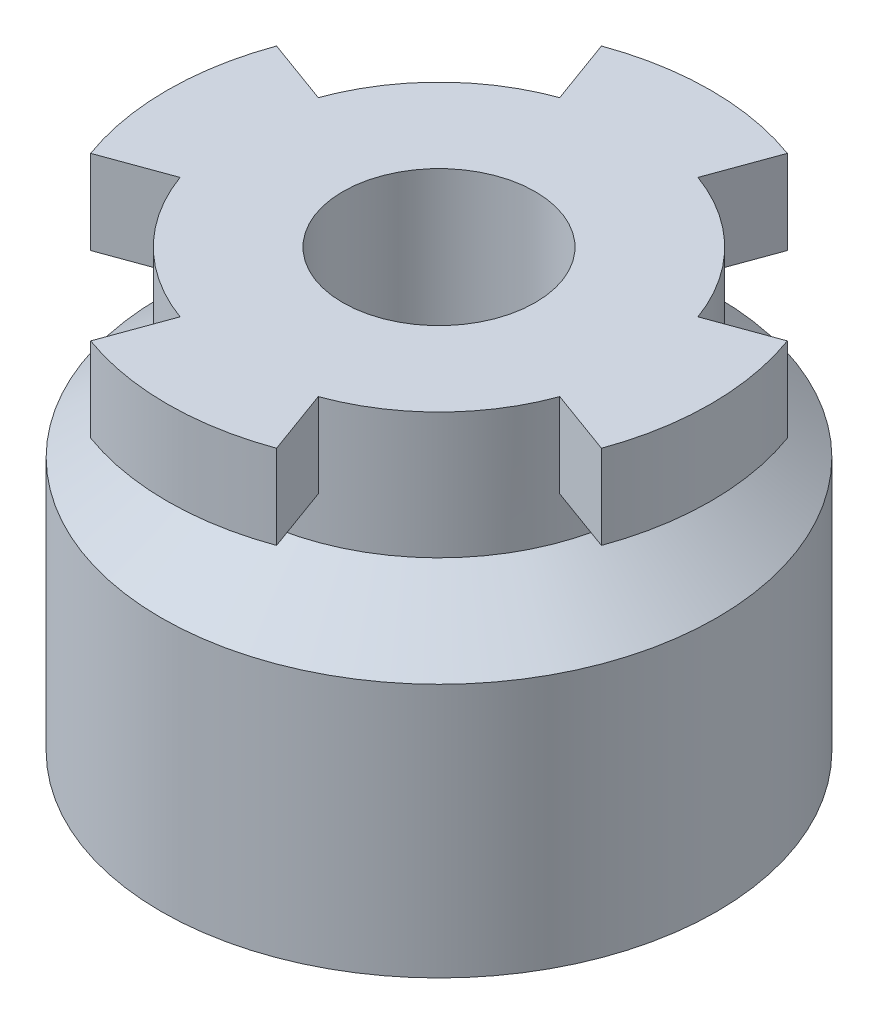
ISO-10303-21;
HEADER;
FILE_DESCRIPTION(('STEP AP214'),'2;1');
FILE_NAME('part.step','',(''),(''),'','','');
FILE_SCHEMA(('AUTOMOTIVE_DESIGN { 1 0 10303 214 1 1 1 1 }'));
ENDSEC;
DATA;
#1=APPLICATION_CONTEXT('core data for automotive mechanical design processes');
#2=APPLICATION_PROTOCOL_DEFINITION('international standard','automotive_design',2000,#1);
#3=PRODUCT_CONTEXT('',#1,'mechanical');
#4=PRODUCT('Part','Part','',(#3));
#5=PRODUCT_RELATED_PRODUCT_CATEGORY('part','',(#4));
#6=PRODUCT_DEFINITION_FORMATION('','',#4);
#7=PRODUCT_DEFINITION_CONTEXT('part definition',#1,'design');
#8=PRODUCT_DEFINITION('design','',#6,#7);
#9=PRODUCT_DEFINITION_SHAPE('','',#8);
#10=(LENGTH_UNIT() NAMED_UNIT(*) SI_UNIT(.MILLI.,.METRE.));
#11=(NAMED_UNIT(*) PLANE_ANGLE_UNIT() SI_UNIT($,.RADIAN.));
#12=(NAMED_UNIT(*) SI_UNIT($,.STERADIAN.) SOLID_ANGLE_UNIT());
#13=UNCERTAINTY_MEASURE_WITH_UNIT(LENGTH_MEASURE(1.E-05),#10,'distance_accuracy_value','');
#14=(GEOMETRIC_REPRESENTATION_CONTEXT(3) GLOBAL_UNCERTAINTY_ASSIGNED_CONTEXT((#13)) GLOBAL_UNIT_ASSIGNED_CONTEXT((#10,
#11,#12)) REPRESENTATION_CONTEXT('',''));
#15=CARTESIAN_POINT('',(0.,0.,0.));
#16=DIRECTION('',(0.,0.,1.));
#17=DIRECTION('',(1.,0.,0.));
#18=AXIS2_PLACEMENT_3D('',#15,#16,#17);
#19=CARTESIAN_POINT('',(0.,22.3,0.));
#20=DIRECTION('',(0.,1.,0.));
#21=DIRECTION('',(-1.,0.,0.));
#22=AXIS2_PLACEMENT_3D('',#19,#20,#21);
#23=CYLINDRICAL_SURFACE('',#22,16.8);
#24=CARTESIAN_POINT('',(0.,25.8,0.));
#25=DIRECTION('',(0.,1.,0.));
#26=DIRECTION('',(-1.,0.,0.));
#27=AXIS2_PLACEMENT_3D('',#24,#25,#26);
#28=CIRCLE('',#27,16.8);
#29=CARTESIAN_POINT('',(-16.8,25.8,0.));
#30=VERTEX_POINT('',#29);
#31=EDGE_CURVE('E184',#30,#30,#28,.T.);
#32=ORIENTED_EDGE('',*,*,#31,.T.);
#33=EDGE_LOOP('',(#32));
#34=FACE_BOUND('',#33,.T.);
#35=CARTESIAN_POINT('',(0.,36.3,0.));
#36=DIRECTION('',(0.,1.,0.));
#37=DIRECTION('',(-1.,0.,0.));
#38=AXIS2_PLACEMENT_3D('',#35,#36,#37);
#39=CIRCLE('',#38,16.8);
#40=CARTESIAN_POINT('',(15.7868360292033,36.3,-5.7459384078712));
#41=VERTEX_POINT('',#40);
#42=CARTESIAN_POINT('',(5.74593840787125,36.3,-15.7868360292033));
#43=VERTEX_POINT('',#42);
#44=EDGE_CURVE('E177',#41,#43,#39,.T.);
#45=ORIENTED_EDGE('',*,*,#44,.F.);
#46=DIRECTION('',(0.,1.,0.));
#47=VECTOR('',#46,1.);
#48=CARTESIAN_POINT('',(15.7868360292033,29.3,-5.7459384078712));
#49=LINE('',#48,#47);
#50=CARTESIAN_POINT('',(15.7868360292033,29.3,-5.7459384078712));
#51=VERTEX_POINT('',#50);
#52=EDGE_CURVE('E51',#51,#41,#49,.T.);
#53=ORIENTED_EDGE('',*,*,#52,.F.);
#54=CARTESIAN_POINT('',(0.,29.3,0.));
#55=DIRECTION('',(0.,1.,0.));
#56=DIRECTION('',(-1.,0.,0.));
#57=AXIS2_PLACEMENT_3D('',#54,#55,#56);
#58=CIRCLE('',#57,16.8);
#59=CARTESIAN_POINT('',(15.7868360292032,29.3,5.74593840787131));
#60=VERTEX_POINT('',#59);
#61=EDGE_CURVE('E161',#60,#51,#58,.T.);
#62=ORIENTED_EDGE('',*,*,#61,.F.);
#63=DIRECTION('',(0.,1.,0.));
#64=VECTOR('',#63,1.);
#65=CARTESIAN_POINT('',(15.7868360292032,29.3,5.74593840787131));
#66=LINE('',#65,#64);
#67=CARTESIAN_POINT('',(15.7868360292032,36.3,5.74593840787131));
#68=VERTEX_POINT('',#67);
#69=EDGE_CURVE('E152',#60,#68,#66,.T.);
#70=ORIENTED_EDGE('',*,*,#69,.T.);
#71=CARTESIAN_POINT('',(5.74593840787115,36.3,15.7868360292033));
#72=VERTEX_POINT('',#71);
#73=EDGE_CURVE('E167',#72,#68,#39,.T.);
#74=ORIENTED_EDGE('',*,*,#73,.F.);
#75=DIRECTION('',(0.,1.,0.));
#76=VECTOR('',#75,1.);
#77=CARTESIAN_POINT('',(5.74593840787115,29.3,15.7868360292033));
#78=LINE('',#77,#76);
#79=CARTESIAN_POINT('',(5.74593840787115,29.3,15.7868360292033));
#80=VERTEX_POINT('',#79);
#81=EDGE_CURVE('E59',#80,#72,#78,.T.);
#82=ORIENTED_EDGE('',*,*,#81,.F.);
#83=CARTESIAN_POINT('',(0.,29.3,0.));
#84=DIRECTION('',(0.,1.,0.));
#85=DIRECTION('',(-1.,0.,0.));
#86=AXIS2_PLACEMENT_3D('',#83,#84,#85);
#87=CIRCLE('',#86,16.8);
#88=CARTESIAN_POINT('',(-5.74593840787136,29.3,15.7868360292032));
#89=VERTEX_POINT('',#88);
#90=EDGE_CURVE('E308',#89,#80,#87,.T.);
#91=ORIENTED_EDGE('',*,*,#90,.F.);
#92=DIRECTION('',(0.,1.,0.));
#93=VECTOR('',#92,1.);
#94=CARTESIAN_POINT('',(-5.74593840787136,29.3,15.7868360292032));
#95=LINE('',#94,#93);
#96=CARTESIAN_POINT('',(-5.74593840787136,36.3,15.7868360292032));
#97=VERTEX_POINT('',#96);
#98=EDGE_CURVE('E300',#89,#97,#95,.T.);
#99=ORIENTED_EDGE('',*,*,#98,.T.);
#100=CARTESIAN_POINT('',(-15.7868360292033,36.3,5.74593840787109));
#101=VERTEX_POINT('',#100);
#102=EDGE_CURVE('E176',#101,#97,#39,.T.);
#103=ORIENTED_EDGE('',*,*,#102,.F.);
#104=DIRECTION('',(0.,1.,0.));
#105=VECTOR('',#104,1.);
#106=CARTESIAN_POINT('',(-15.7868360292033,29.3,5.74593840787109));
#107=LINE('',#106,#105);
#108=CARTESIAN_POINT('',(-15.7868360292033,29.3,5.74593840787109));
#109=VERTEX_POINT('',#108);
#110=EDGE_CURVE('E312',#109,#101,#107,.T.);
#111=ORIENTED_EDGE('',*,*,#110,.F.);
#112=CARTESIAN_POINT('',(0.,29.3,0.));
#113=DIRECTION('',(0.,1.,0.));
#114=DIRECTION('',(-1.,0.,0.));
#115=AXIS2_PLACEMENT_3D('',#112,#113,#114);
#116=CIRCLE('',#115,16.8);
#117=CARTESIAN_POINT('',(-15.7868360292032,29.3,-5.74593840787142));
#118=VERTEX_POINT('',#117);
#119=EDGE_CURVE('E335',#118,#109,#116,.T.);
#120=ORIENTED_EDGE('',*,*,#119,.F.);
#121=DIRECTION('',(0.,1.,0.));
#122=VECTOR('',#121,1.);
#123=CARTESIAN_POINT('',(-15.7868360292032,29.3,-5.74593840787142));
#124=LINE('',#123,#122);
#125=CARTESIAN_POINT('',(-15.7868360292032,36.3,-5.74593840787142));
#126=VERTEX_POINT('',#125);
#127=EDGE_CURVE('E327',#118,#126,#124,.T.);
#128=ORIENTED_EDGE('',*,*,#127,.T.);
#129=CARTESIAN_POINT('',(-5.74593840787126,36.3,-15.7868360292033));
#130=VERTEX_POINT('',#129);
#131=EDGE_CURVE('E180',#130,#126,#39,.T.);
#132=ORIENTED_EDGE('',*,*,#131,.F.);
#133=DIRECTION('',(0.,1.,0.));
#134=VECTOR('',#133,1.);
#135=CARTESIAN_POINT('',(-5.74593840787126,29.3,-15.7868360292033));
#136=LINE('',#135,#134);
#137=CARTESIAN_POINT('',(-5.74593840787126,29.3,-15.7868360292033));
#138=VERTEX_POINT('',#137);
#139=EDGE_CURVE('E372',#138,#130,#136,.T.);
#140=ORIENTED_EDGE('',*,*,#139,.F.);
#141=CARTESIAN_POINT('',(0.,29.3,0.));
#142=DIRECTION('',(0.,1.,0.));
#143=DIRECTION('',(0.,0.,1.));
#144=AXIS2_PLACEMENT_3D('',#141,#142,#143);
#145=CIRCLE('',#144,16.8);
#146=CARTESIAN_POINT('',(5.74593840787125,29.3,-15.7868360292033));
#147=VERTEX_POINT('',#146);
#148=EDGE_CURVE('E354',#147,#138,#145,.T.);
#149=ORIENTED_EDGE('',*,*,#148,.F.);
#150=DIRECTION('',(0.,1.,0.));
#151=VECTOR('',#150,1.);
#152=CARTESIAN_POINT('',(5.74593840787125,29.3,-15.7868360292033));
#153=LINE('',#152,#151);
#154=EDGE_CURVE('E369',#147,#43,#153,.T.);
#155=ORIENTED_EDGE('',*,*,#154,.T.);
#156=EDGE_LOOP('',(#45,#53,#62,#70,#74,#82,#91,#99,#103,#111,#120,#128,#132,#140,#149,#155));
#157=FACE_BOUND('',#156,.T.);
#158=ADVANCED_FACE('F36',(#34,#157),#23,.T.);
#159=CARTESIAN_POINT('',(0.,0.,0.));
#160=DIRECTION('',(0.,-1.,0.));
#161=DIRECTION('',(1.,0.,0.));
#162=AXIS2_PLACEMENT_3D('',#159,#160,#161);
#163=PLANE('',#162);
#164=CARTESIAN_POINT('',(0.,0.,0.));
#165=DIRECTION('',(0.,1.,0.));
#166=DIRECTION('',(-1.,0.,0.));
#167=AXIS2_PLACEMENT_3D('',#164,#165,#166);
#168=CIRCLE('',#167,23.1);
#169=CARTESIAN_POINT('',(-23.1,0.,0.));
#170=VERTEX_POINT('',#169);
#171=EDGE_CURVE('E11',#170,#170,#168,.T.);
#172=ORIENTED_EDGE('',*,*,#171,.F.);
#173=EDGE_LOOP('',(#172));
#174=FACE_BOUND('',#173,.T.);
#175=ADVANCED_FACE('F38',(#174),#163,.T.);
#176=CARTESIAN_POINT('',(0.,22.3,0.));
#177=DIRECTION('',(0.,1.,0.));
#178=DIRECTION('',(-1.,0.,0.));
#179=AXIS2_PLACEMENT_3D('',#176,#177,#178);
#180=CYLINDRICAL_SURFACE('',#179,23.1);
#181=ORIENTED_EDGE('',*,*,#171,.T.);
#182=EDGE_LOOP('',(#181));
#183=FACE_BOUND('',#182,.T.);
#184=CARTESIAN_POINT('',(0.,21.15,0.));
#185=DIRECTION('',(0.,1.,0.));
#186=DIRECTION('',(-1.,0.,0.));
#187=AXIS2_PLACEMENT_3D('',#184,#185,#186);
#188=CIRCLE('',#187,23.1);
#189=CARTESIAN_POINT('',(-23.1,21.15,0.));
#190=VERTEX_POINT('',#189);
#191=EDGE_CURVE('E44',#190,#190,#188,.T.);
#192=ORIENTED_EDGE('',*,*,#191,.F.);
#193=EDGE_LOOP('',(#192));
#194=FACE_BOUND('',#193,.T.);
#195=ADVANCED_FACE('F193',(#183,#194),#180,.T.);
#196=CARTESIAN_POINT('',(0.,25.8,0.));
#197=DIRECTION('',(0.,-1.,0.));
#198=DIRECTION('',(1.,0.,0.));
#199=AXIS2_PLACEMENT_3D('',#196,#197,#198);
#200=CONICAL_SURFACE('',#199,16.8,0.934957903271151);
#201=ORIENTED_EDGE('',*,*,#191,.T.);
#202=EDGE_LOOP('',(#201));
#203=FACE_BOUND('',#202,.T.);
#204=ORIENTED_EDGE('',*,*,#31,.F.);
#205=EDGE_LOOP('',(#204));
#206=FACE_BOUND('',#205,.T.);
#207=ADVANCED_FACE('F190',(#203,#206),#200,.T.);
#208=CARTESIAN_POINT('',(-16.8,36.3,0.));
#209=DIRECTION('',(0.,1.,0.));
#210=DIRECTION('',(-1.,0.,0.));
#211=AXIS2_PLACEMENT_3D('',#208,#209,#210);
#212=PLANE('',#211);
#213=ORIENTED_EDGE('',*,*,#131,.T.);
#214=DIRECTION('',(-0.939692620785919,0.,-0.34202014332564));
#215=VECTOR('',#214,1.);
#216=CARTESIAN_POINT('',(-15.7868360292032,36.3,-5.74593840787142));
#217=LINE('',#216,#215);
#218=CARTESIAN_POINT('',(-21.2370532297615,36.3,-7.72965523916012));
#219=VERTEX_POINT('',#218);
#220=EDGE_CURVE('E331',#126,#219,#217,.T.);
#221=ORIENTED_EDGE('',*,*,#220,.T.);
#222=CARTESIAN_POINT('',(0.,36.3,0.));
#223=DIRECTION('',(0.,-1.,0.));
#224=DIRECTION('',(1.,0.,0.));
#225=AXIS2_PLACEMENT_3D('',#222,#223,#224);
#226=CIRCLE('',#225,22.6);
#227=CARTESIAN_POINT('',(-21.2370532297616,36.3,7.72965523915992));
#228=VERTEX_POINT('',#227);
#229=EDGE_CURVE('E334',#228,#219,#226,.T.);
#230=ORIENTED_EDGE('',*,*,#229,.F.);
#231=DIRECTION('',(-0.939692620785912,0.,0.34202014332566));
#232=VECTOR('',#231,1.);
#233=CARTESIAN_POINT('',(-15.7868360292033,36.3,5.74593840787109));
#234=LINE('',#233,#232);
#235=EDGE_CURVE('E338',#101,#228,#234,.T.);
#236=ORIENTED_EDGE('',*,*,#235,.F.);
#237=ORIENTED_EDGE('',*,*,#102,.T.);
#238=DIRECTION('',(-0.342020143325651,0.,0.939692620785915));
#239=VECTOR('',#238,1.);
#240=CARTESIAN_POINT('',(-5.74593840787136,36.3,15.7868360292032));
#241=LINE('',#240,#239);
#242=CARTESIAN_POINT('',(-7.72965523916013,36.3,21.2370532297615));
#243=VERTEX_POINT('',#242);
#244=EDGE_CURVE('E304',#97,#243,#241,.T.);
#245=ORIENTED_EDGE('',*,*,#244,.T.);
#246=CARTESIAN_POINT('',(0.,36.3,0.));
#247=DIRECTION('',(0.,-1.,0.));
#248=DIRECTION('',(1.,0.,0.));
#249=AXIS2_PLACEMENT_3D('',#246,#247,#248);
#250=CIRCLE('',#249,22.6);
#251=CARTESIAN_POINT('',(7.72965523915999,36.3,21.2370532297616));
#252=VERTEX_POINT('',#251);
#253=EDGE_CURVE('E307',#252,#243,#250,.T.);
#254=ORIENTED_EDGE('',*,*,#253,.F.);
#255=DIRECTION('',(0.342020143325663,0.,0.93969262078591));
#256=VECTOR('',#255,1.);
#257=CARTESIAN_POINT('',(5.74593840787115,36.3,15.7868360292033));
#258=LINE('',#257,#256);
#259=EDGE_CURVE('E175',#72,#252,#258,.T.);
#260=ORIENTED_EDGE('',*,*,#259,.F.);
#261=ORIENTED_EDGE('',*,*,#73,.T.);
#262=DIRECTION('',(0.939692620785912,0.,0.342020143325658));
#263=VECTOR('',#262,1.);
#264=CARTESIAN_POINT('',(15.7868360292032,36.3,5.74593840787131));
#265=LINE('',#264,#263);
#266=CARTESIAN_POINT('',(21.2370532297615,36.3,7.72965523916012));
#267=VERTEX_POINT('',#266);
#268=EDGE_CURVE('E148',#68,#267,#265,.T.);
#269=ORIENTED_EDGE('',*,*,#268,.T.);
#270=CARTESIAN_POINT('',(0.,36.3,0.));
#271=DIRECTION('',(0.,-1.,0.));
#272=DIRECTION('',(1.,0.,0.));
#273=AXIS2_PLACEMENT_3D('',#270,#271,#272);
#274=CIRCLE('',#273,22.6);
#275=CARTESIAN_POINT('',(21.2370532297615,36.3,-7.72965523916007));
#276=VERTEX_POINT('',#275);
#277=EDGE_CURVE('E160',#276,#267,#274,.T.);
#278=ORIENTED_EDGE('',*,*,#277,.F.);
#279=DIRECTION('',(0.939692620785909,0.,-0.342020143325667));
#280=VECTOR('',#279,1.);
#281=CARTESIAN_POINT('',(15.7868360292033,36.3,-5.7459384078712));
#282=LINE('',#281,#280);
#283=EDGE_CURVE('E280',#41,#276,#282,.T.);
#284=ORIENTED_EDGE('',*,*,#283,.F.);
#285=ORIENTED_EDGE('',*,*,#44,.T.);
#286=DIRECTION('',(0.34202014332567,0.,-0.939692620785908));
#287=VECTOR('',#286,1.);
#288=CARTESIAN_POINT('',(0.,36.3,0.));
#289=LINE('',#288,#287);
#290=CARTESIAN_POINT('',(7.72965523916013,36.3,-21.2370532297615));
#291=VERTEX_POINT('',#290);
#292=EDGE_CURVE('E352',#43,#291,#289,.T.);
#293=ORIENTED_EDGE('',*,*,#292,.T.);
#294=CARTESIAN_POINT('',(0.,36.3,0.));
#295=DIRECTION('',(0.,1.,0.));
#296=DIRECTION('',(0.,0.,1.));
#297=AXIS2_PLACEMENT_3D('',#294,#295,#296);
#298=CIRCLE('',#297,22.6);
#299=CARTESIAN_POINT('',(-7.72965523916014,36.3,-21.2370532297615));
#300=VERTEX_POINT('',#299);
#301=EDGE_CURVE('E340',#300,#291,#298,.F.);
#302=ORIENTED_EDGE('',*,*,#301,.F.);
#303=DIRECTION('',(-0.34202014332567,0.,-0.939692620785908));
#304=VECTOR('',#303,1.);
#305=CARTESIAN_POINT('',(0.,36.3,0.));
#306=LINE('',#305,#304);
#307=EDGE_CURVE('E362',#130,#300,#306,.T.);
#308=ORIENTED_EDGE('',*,*,#307,.F.);
#309=EDGE_LOOP('',(#213,#221,#230,#236,#237,#245,#254,#260,#261,#269,#278,#284,#285,#293,#302,#308));
#310=FACE_BOUND('',#309,.T.);
#311=CARTESIAN_POINT('',(0.,36.3,0.));
#312=DIRECTION('',(0.,1.,0.));
#313=DIRECTION('',(-1.,0.,0.));
#314=AXIS2_PLACEMENT_3D('',#311,#312,#313);
#315=CIRCLE('',#314,8.);
#316=CARTESIAN_POINT('',(-8.,36.3,0.));
#317=VERTEX_POINT('',#316);
#318=EDGE_CURVE('E181',#317,#317,#315,.T.);
#319=ORIENTED_EDGE('',*,*,#318,.F.);
#320=EDGE_LOOP('',(#319));
#321=FACE_BOUND('',#320,.T.);
#322=ADVANCED_FACE('F172',(#310,#321),#212,.T.);
#323=CARTESIAN_POINT('',(0.,22.3,0.));
#324=DIRECTION('',(0.,1.,0.));
#325=DIRECTION('',(-1.,0.,0.));
#326=AXIS2_PLACEMENT_3D('',#323,#324,#325);
#327=CYLINDRICAL_SURFACE('',#326,8.);
#328=ORIENTED_EDGE('',*,*,#318,.T.);
#329=EDGE_LOOP('',(#328));
#330=FACE_BOUND('',#329,.T.);
#331=CARTESIAN_POINT('',(0.,22.3,0.));
#332=DIRECTION('',(0.,1.,0.));
#333=DIRECTION('',(-1.,0.,0.));
#334=AXIS2_PLACEMENT_3D('',#331,#332,#333);
#335=CIRCLE('',#334,8.);
#336=CARTESIAN_POINT('',(-8.,22.3,0.));
#337=VERTEX_POINT('',#336);
#338=EDGE_CURVE('E368',#337,#337,#335,.T.);
#339=ORIENTED_EDGE('',*,*,#338,.F.);
#340=EDGE_LOOP('',(#339));
#341=FACE_BOUND('',#340,.T.);
#342=ADVANCED_FACE('F210',(#330,#341),#327,.F.);
#343=CARTESIAN_POINT('',(-8.,22.3,0.));
#344=DIRECTION('',(0.,1.,0.));
#345=DIRECTION('',(-1.,0.,0.));
#346=AXIS2_PLACEMENT_3D('',#343,#344,#345);
#347=PLANE('',#346);
#348=ORIENTED_EDGE('',*,*,#338,.T.);
#349=EDGE_LOOP('',(#348));
#350=FACE_BOUND('',#349,.T.);
#351=ADVANCED_FACE('F213',(#350),#347,.T.);
#352=CARTESIAN_POINT('',(0.,29.3,0.));
#353=DIRECTION('',(0.,1.,0.));
#354=DIRECTION('',(-1.,0.,0.));
#355=AXIS2_PLACEMENT_3D('',#352,#353,#354);
#356=CYLINDRICAL_SURFACE('',#355,22.6);
#357=ORIENTED_EDGE('',*,*,#301,.T.);
#358=DIRECTION('',(0.,1.,0.));
#359=VECTOR('',#358,1.);
#360=CARTESIAN_POINT('',(7.72965523916013,29.3,-21.2370532297615));
#361=LINE('',#360,#359);
#362=CARTESIAN_POINT('',(7.72965523916013,29.3,-21.2370532297615));
#363=VERTEX_POINT('',#362);
#364=EDGE_CURVE('E366',#363,#291,#361,.T.);
#365=ORIENTED_EDGE('',*,*,#364,.F.);
#366=CARTESIAN_POINT('',(0.,29.3,0.));
#367=DIRECTION('',(0.,1.,0.));
#368=DIRECTION('',(0.,0.,1.));
#369=AXIS2_PLACEMENT_3D('',#366,#367,#368);
#370=CIRCLE('',#369,22.6);
#371=CARTESIAN_POINT('',(-7.72965523916014,29.3,-21.2370532297615));
#372=VERTEX_POINT('',#371);
#373=EDGE_CURVE('E349',#372,#363,#370,.F.);
#374=ORIENTED_EDGE('',*,*,#373,.F.);
#375=DIRECTION('',(0.,1.,0.));
#376=VECTOR('',#375,1.);
#377=CARTESIAN_POINT('',(-7.72965523916014,29.3,-21.2370532297615));
#378=LINE('',#377,#376);
#379=EDGE_CURVE('E359',#372,#300,#378,.T.);
#380=ORIENTED_EDGE('',*,*,#379,.T.);
#381=EDGE_LOOP('',(#357,#365,#374,#380));
#382=FACE_BOUND('',#381,.T.);
#383=ADVANCED_FACE('F217',(#382),#356,.T.);
#384=CARTESIAN_POINT('',(0.,29.3,0.));
#385=DIRECTION('',(0.939692620785908,0.,0.34202014332567));
#386=DIRECTION('',(0.34202014332567,0.,-0.939692620785908));
#387=AXIS2_PLACEMENT_3D('',#384,#385,#386);
#388=PLANE('',#387);
#389=ORIENTED_EDGE('',*,*,#292,.F.);
#390=ORIENTED_EDGE('',*,*,#154,.F.);
#391=DIRECTION('',(0.34202014332567,0.,-0.939692620785908));
#392=VECTOR('',#391,1.);
#393=CARTESIAN_POINT('',(0.,29.3,0.));
#394=LINE('',#393,#392);
#395=EDGE_CURVE('E356',#147,#363,#394,.T.);
#396=ORIENTED_EDGE('',*,*,#395,.T.);
#397=ORIENTED_EDGE('',*,*,#364,.T.);
#398=EDGE_LOOP('',(#389,#390,#396,#397));
#399=FACE_BOUND('',#398,.T.);
#400=ADVANCED_FACE('F221',(#399),#388,.T.);
#401=CARTESIAN_POINT('',(0.,29.3,0.));
#402=DIRECTION('',(0.939692620785908,0.,-0.34202014332567));
#403=DIRECTION('',(-0.34202014332567,0.,-0.939692620785908));
#404=AXIS2_PLACEMENT_3D('',#401,#402,#403);
#405=PLANE('',#404);
#406=ORIENTED_EDGE('',*,*,#307,.T.);
#407=ORIENTED_EDGE('',*,*,#379,.F.);
#408=DIRECTION('',(-0.34202014332567,0.,-0.939692620785908));
#409=VECTOR('',#408,1.);
#410=CARTESIAN_POINT('',(0.,29.3,0.));
#411=LINE('',#410,#409);
#412=EDGE_CURVE('E351',#138,#372,#411,.T.);
#413=ORIENTED_EDGE('',*,*,#412,.F.);
#414=ORIENTED_EDGE('',*,*,#139,.T.);
#415=EDGE_LOOP('',(#406,#407,#413,#414));
#416=FACE_BOUND('',#415,.T.);
#417=ADVANCED_FACE('F223',(#416),#405,.F.);
#418=CARTESIAN_POINT('',(0.,29.3,0.));
#419=DIRECTION('',(0.,1.,0.));
#420=DIRECTION('',(0.,0.,1.));
#421=AXIS2_PLACEMENT_3D('',#418,#419,#420);
#422=PLANE('',#421);
#423=ORIENTED_EDGE('',*,*,#373,.T.);
#424=ORIENTED_EDGE('',*,*,#395,.F.);
#425=ORIENTED_EDGE('',*,*,#148,.T.);
#426=ORIENTED_EDGE('',*,*,#412,.T.);
#427=EDGE_LOOP('',(#423,#424,#425,#426));
#428=FACE_BOUND('',#427,.T.);
#429=ADVANCED_FACE('F226',(#428),#422,.F.);
#430=CARTESIAN_POINT('',(-15.7868360292033,29.3,5.74593840787109));
#431=DIRECTION('',(-0.34202014332566,0.,-0.939692620785911));
#432=DIRECTION('',(-0.939692620785912,0.,0.34202014332566));
#433=AXIS2_PLACEMENT_3D('',#430,#431,#432);
#434=PLANE('',#433);
#435=ORIENTED_EDGE('',*,*,#235,.T.);
#436=DIRECTION('',(0.,1.,0.));
#437=VECTOR('',#436,1.);
#438=CARTESIAN_POINT('',(-21.2370532297616,29.3,7.72965523915992));
#439=LINE('',#438,#437);
#440=CARTESIAN_POINT('',(-21.2370532297616,29.3,7.72965523915992));
#441=VERTEX_POINT('',#440);
#442=EDGE_CURVE('E322',#441,#228,#439,.T.);
#443=ORIENTED_EDGE('',*,*,#442,.F.);
#444=DIRECTION('',(-0.939692620785912,0.,0.34202014332566));
#445=VECTOR('',#444,1.);
#446=CARTESIAN_POINT('',(-15.7868360292033,29.3,5.74593840787109));
#447=LINE('',#446,#445);
#448=EDGE_CURVE('E345',#109,#441,#447,.T.);
#449=ORIENTED_EDGE('',*,*,#448,.F.);
#450=ORIENTED_EDGE('',*,*,#110,.T.);
#451=EDGE_LOOP('',(#435,#443,#449,#450));
#452=FACE_BOUND('',#451,.T.);
#453=ADVANCED_FACE('F233',(#452),#434,.F.);
#454=CARTESIAN_POINT('',(0.,29.3,0.));
#455=DIRECTION('',(0.,1.,0.));
#456=DIRECTION('',(-1.,0.,0.));
#457=AXIS2_PLACEMENT_3D('',#454,#455,#456);
#458=CYLINDRICAL_SURFACE('',#457,22.6);
#459=ORIENTED_EDGE('',*,*,#229,.T.);
#460=DIRECTION('',(0.,1.,0.));
#461=VECTOR('',#460,1.);
#462=CARTESIAN_POINT('',(-21.2370532297615,29.3,-7.72965523916012));
#463=LINE('',#462,#461);
#464=CARTESIAN_POINT('',(-21.2370532297615,29.3,-7.72965523916012));
#465=VERTEX_POINT('',#464);
#466=EDGE_CURVE('E325',#465,#219,#463,.T.);
#467=ORIENTED_EDGE('',*,*,#466,.F.);
#468=CARTESIAN_POINT('',(0.,29.3,0.));
#469=DIRECTION('',(0.,-1.,0.));
#470=DIRECTION('',(1.,0.,0.));
#471=AXIS2_PLACEMENT_3D('',#468,#469,#470);
#472=CIRCLE('',#471,22.6);
#473=EDGE_CURVE('E343',#441,#465,#472,.T.);
#474=ORIENTED_EDGE('',*,*,#473,.F.);
#475=ORIENTED_EDGE('',*,*,#442,.T.);
#476=EDGE_LOOP('',(#459,#467,#474,#475));
#477=FACE_BOUND('',#476,.T.);
#478=ADVANCED_FACE('F243',(#477),#458,.T.);
#479=CARTESIAN_POINT('',(-15.7868360292032,29.3,-5.74593840787142));
#480=DIRECTION('',(0.34202014332564,0.,-0.939692620785919));
#481=DIRECTION('',(-0.939692620785919,0.,-0.34202014332564));
#482=AXIS2_PLACEMENT_3D('',#479,#480,#481);
#483=PLANE('',#482);
#484=ORIENTED_EDGE('',*,*,#220,.F.);
#485=ORIENTED_EDGE('',*,*,#127,.F.);
#486=DIRECTION('',(-0.939692620785919,0.,-0.34202014332564));
#487=VECTOR('',#486,1.);
#488=CARTESIAN_POINT('',(-15.7868360292032,29.3,-5.74593840787142));
#489=LINE('',#488,#487);
#490=EDGE_CURVE('E330',#118,#465,#489,.T.);
#491=ORIENTED_EDGE('',*,*,#490,.T.);
#492=ORIENTED_EDGE('',*,*,#466,.T.);
#493=EDGE_LOOP('',(#484,#485,#491,#492));
#494=FACE_BOUND('',#493,.T.);
#495=ADVANCED_FACE('F239',(#494),#483,.T.);
#496=CARTESIAN_POINT('',(0.,29.3,0.));
#497=DIRECTION('',(0.,1.,0.));
#498=DIRECTION('',(-1.,0.,0.));
#499=AXIS2_PLACEMENT_3D('',#496,#497,#498);
#500=PLANE('',#499);
#501=ORIENTED_EDGE('',*,*,#119,.T.);
#502=ORIENTED_EDGE('',*,*,#448,.T.);
#503=ORIENTED_EDGE('',*,*,#473,.T.);
#504=ORIENTED_EDGE('',*,*,#490,.F.);
#505=EDGE_LOOP('',(#501,#502,#503,#504));
#506=FACE_BOUND('',#505,.T.);
#507=ADVANCED_FACE('F235',(#506),#500,.F.);
#508=CARTESIAN_POINT('',(5.74593840787115,29.3,15.7868360292033));
#509=DIRECTION('',(-0.93969262078591,0.,0.342020143325663));
#510=DIRECTION('',(0.342020143325663,0.,0.93969262078591));
#511=AXIS2_PLACEMENT_3D('',#508,#509,#510);
#512=PLANE('',#511);
#513=ORIENTED_EDGE('',*,*,#259,.T.);
#514=DIRECTION('',(0.,1.,0.));
#515=VECTOR('',#514,1.);
#516=CARTESIAN_POINT('',(7.72965523915999,29.3,21.2370532297616));
#517=LINE('',#516,#515);
#518=CARTESIAN_POINT('',(7.72965523915999,29.3,21.2370532297616));
#519=VERTEX_POINT('',#518);
#520=EDGE_CURVE('E295',#519,#252,#517,.T.);
#521=ORIENTED_EDGE('',*,*,#520,.F.);
#522=DIRECTION('',(0.342020143325663,0.,0.93969262078591));
#523=VECTOR('',#522,1.);
#524=CARTESIAN_POINT('',(5.74593840787115,29.3,15.7868360292033));
#525=LINE('',#524,#523);
#526=EDGE_CURVE('E317',#80,#519,#525,.T.);
#527=ORIENTED_EDGE('',*,*,#526,.F.);
#528=ORIENTED_EDGE('',*,*,#81,.T.);
#529=EDGE_LOOP('',(#513,#521,#527,#528));
#530=FACE_BOUND('',#529,.T.);
#531=ADVANCED_FACE('F238',(#530),#512,.F.);
#532=CARTESIAN_POINT('',(0.,29.3,0.));
#533=DIRECTION('',(0.,1.,0.));
#534=DIRECTION('',(-1.,0.,0.));
#535=AXIS2_PLACEMENT_3D('',#532,#533,#534);
#536=CYLINDRICAL_SURFACE('',#535,22.6);
#537=ORIENTED_EDGE('',*,*,#253,.T.);
#538=DIRECTION('',(0.,1.,0.));
#539=VECTOR('',#538,1.);
#540=CARTESIAN_POINT('',(-7.72965523916013,29.3,21.2370532297615));
#541=LINE('',#540,#539);
#542=CARTESIAN_POINT('',(-7.72965523916013,29.3,21.2370532297615));
#543=VERTEX_POINT('',#542);
#544=EDGE_CURVE('E298',#543,#243,#541,.T.);
#545=ORIENTED_EDGE('',*,*,#544,.F.);
#546=CARTESIAN_POINT('',(0.,29.3,0.));
#547=DIRECTION('',(0.,-1.,0.));
#548=DIRECTION('',(1.,0.,0.));
#549=AXIS2_PLACEMENT_3D('',#546,#547,#548);
#550=CIRCLE('',#549,22.6);
#551=EDGE_CURVE('E315',#519,#543,#550,.T.);
#552=ORIENTED_EDGE('',*,*,#551,.F.);
#553=ORIENTED_EDGE('',*,*,#520,.T.);
#554=EDGE_LOOP('',(#537,#545,#552,#553));
#555=FACE_BOUND('',#554,.T.);
#556=ADVANCED_FACE('F259',(#555),#536,.T.);
#557=CARTESIAN_POINT('',(-5.74593840787136,29.3,15.7868360292032));
#558=DIRECTION('',(-0.939692620785915,0.,-0.34202014332565));
#559=DIRECTION('',(-0.342020143325651,0.,0.939692620785915));
#560=AXIS2_PLACEMENT_3D('',#557,#558,#559);
#561=PLANE('',#560);
#562=ORIENTED_EDGE('',*,*,#244,.F.);
#563=ORIENTED_EDGE('',*,*,#98,.F.);
#564=DIRECTION('',(-0.342020143325651,0.,0.939692620785915));
#565=VECTOR('',#564,1.);
#566=CARTESIAN_POINT('',(-5.74593840787136,29.3,15.7868360292032));
#567=LINE('',#566,#565);
#568=EDGE_CURVE('E303',#89,#543,#567,.T.);
#569=ORIENTED_EDGE('',*,*,#568,.T.);
#570=ORIENTED_EDGE('',*,*,#544,.T.);
#571=EDGE_LOOP('',(#562,#563,#569,#570));
#572=FACE_BOUND('',#571,.T.);
#573=ADVANCED_FACE('F255',(#572),#561,.T.);
#574=CARTESIAN_POINT('',(0.,29.3,0.));
#575=DIRECTION('',(0.,1.,0.));
#576=DIRECTION('',(-1.,0.,0.));
#577=AXIS2_PLACEMENT_3D('',#574,#575,#576);
#578=PLANE('',#577);
#579=ORIENTED_EDGE('',*,*,#90,.T.);
#580=ORIENTED_EDGE('',*,*,#526,.T.);
#581=ORIENTED_EDGE('',*,*,#551,.T.);
#582=ORIENTED_EDGE('',*,*,#568,.F.);
#583=EDGE_LOOP('',(#579,#580,#581,#582));
#584=FACE_BOUND('',#583,.T.);
#585=ADVANCED_FACE('F251',(#584),#578,.F.);
#586=CARTESIAN_POINT('',(15.7868360292033,29.3,-5.7459384078712));
#587=DIRECTION('',(0.342020143325667,0.,0.939692620785909));
#588=DIRECTION('',(0.939692620785909,0.,-0.342020143325667));
#589=AXIS2_PLACEMENT_3D('',#586,#587,#588);
#590=PLANE('',#589);
#591=ORIENTED_EDGE('',*,*,#283,.T.);
#592=DIRECTION('',(0.,1.,0.));
#593=VECTOR('',#592,1.);
#594=CARTESIAN_POINT('',(21.2370532297615,29.3,-7.72965523916007));
#595=LINE('',#594,#593);
#596=CARTESIAN_POINT('',(21.2370532297615,29.3,-7.72965523916007));
#597=VERTEX_POINT('',#596);
#598=EDGE_CURVE('E282',#597,#276,#595,.T.);
#599=ORIENTED_EDGE('',*,*,#598,.F.);
#600=DIRECTION('',(0.939692620785909,0.,-0.342020143325667));
#601=VECTOR('',#600,1.);
#602=CARTESIAN_POINT('',(15.7868360292033,29.3,-5.7459384078712));
#603=LINE('',#602,#601);
#604=EDGE_CURVE('E291',#51,#597,#603,.T.);
#605=ORIENTED_EDGE('',*,*,#604,.F.);
#606=ORIENTED_EDGE('',*,*,#52,.T.);
#607=EDGE_LOOP('',(#591,#599,#605,#606));
#608=FACE_BOUND('',#607,.T.);
#609=ADVANCED_FACE('F254',(#608),#590,.F.);
#610=CARTESIAN_POINT('',(0.,29.3,0.));
#611=DIRECTION('',(0.,1.,0.));
#612=DIRECTION('',(-1.,0.,0.));
#613=AXIS2_PLACEMENT_3D('',#610,#611,#612);
#614=CYLINDRICAL_SURFACE('',#613,22.6);
#615=ORIENTED_EDGE('',*,*,#277,.T.);
#616=DIRECTION('',(0.,1.,0.));
#617=VECTOR('',#616,1.);
#618=CARTESIAN_POINT('',(21.2370532297615,29.3,7.72965523916012));
#619=LINE('',#618,#617);
#620=CARTESIAN_POINT('',(21.2370532297615,29.3,7.72965523916012));
#621=VERTEX_POINT('',#620);
#622=EDGE_CURVE('E155',#621,#267,#619,.T.);
#623=ORIENTED_EDGE('',*,*,#622,.F.);
#624=CARTESIAN_POINT('',(0.,29.3,0.));
#625=DIRECTION('',(0.,-1.,0.));
#626=DIRECTION('',(1.,0.,0.));
#627=AXIS2_PLACEMENT_3D('',#624,#625,#626);
#628=CIRCLE('',#627,22.6);
#629=EDGE_CURVE('E285',#597,#621,#628,.T.);
#630=ORIENTED_EDGE('',*,*,#629,.F.);
#631=ORIENTED_EDGE('',*,*,#598,.T.);
#632=EDGE_LOOP('',(#615,#623,#630,#631));
#633=FACE_BOUND('',#632,.T.);
#634=ADVANCED_FACE('F272',(#633),#614,.T.);
#635=CARTESIAN_POINT('',(15.7868360292032,29.3,5.74593840787131));
#636=DIRECTION('',(-0.342020143325658,0.,0.939692620785912));
#637=DIRECTION('',(0.939692620785912,0.,0.342020143325658));
#638=AXIS2_PLACEMENT_3D('',#635,#636,#637);
#639=PLANE('',#638);
#640=ORIENTED_EDGE('',*,*,#268,.F.);
#641=ORIENTED_EDGE('',*,*,#69,.F.);
#642=DIRECTION('',(0.939692620785912,0.,0.342020143325658));
#643=VECTOR('',#642,1.);
#644=CARTESIAN_POINT('',(15.7868360292032,29.3,5.74593840787131));
#645=LINE('',#644,#643);
#646=EDGE_CURVE('E169',#60,#621,#645,.T.);
#647=ORIENTED_EDGE('',*,*,#646,.T.);
#648=ORIENTED_EDGE('',*,*,#622,.T.);
#649=EDGE_LOOP('',(#640,#641,#647,#648));
#650=FACE_BOUND('',#649,.T.);
#651=ADVANCED_FACE('F150',(#650),#639,.T.);
#652=CARTESIAN_POINT('',(0.,29.3,0.));
#653=DIRECTION('',(0.,1.,0.));
#654=DIRECTION('',(-1.,0.,0.));
#655=AXIS2_PLACEMENT_3D('',#652,#653,#654);
#656=PLANE('',#655);
#657=ORIENTED_EDGE('',*,*,#61,.T.);
#658=ORIENTED_EDGE('',*,*,#604,.T.);
#659=ORIENTED_EDGE('',*,*,#629,.T.);
#660=ORIENTED_EDGE('',*,*,#646,.F.);
#661=EDGE_LOOP('',(#657,#658,#659,#660));
#662=FACE_BOUND('',#661,.T.);
#663=ADVANCED_FACE('F266',(#662),#656,.F.);
#664=CLOSED_SHELL('',(#158,#175,#195,#207,#322,#342,#351,#383,#400,#417,#429,#453,#478,#495,
#507,#531,#556,#573,#585,#609,#634,#651,#663));
#665=MANIFOLD_SOLID_BREP('B2',#664);
#666=ADVANCED_BREP_SHAPE_REPRESENTATION('',(#18,#665),#14);
#667=SHAPE_DEFINITION_REPRESENTATION(#9,#666);
ENDSEC;
END-ISO-10303-21;
